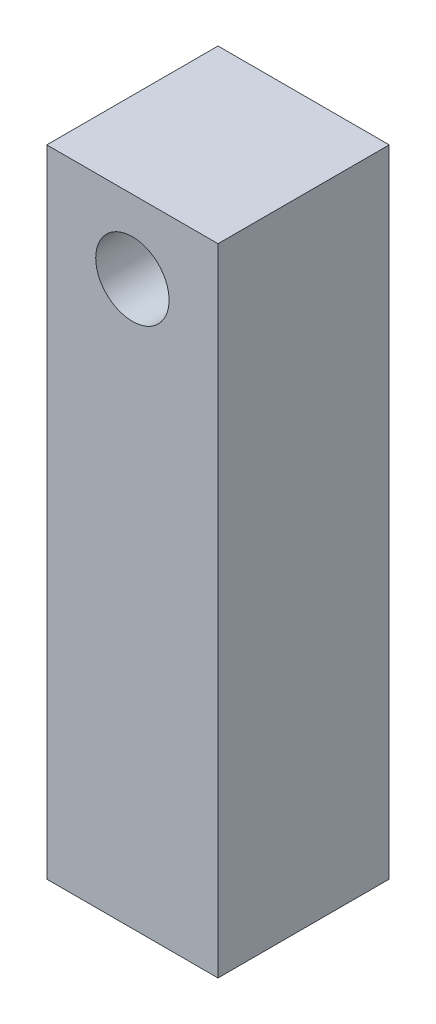
ISO-10303-21;
HEADER;
FILE_DESCRIPTION(('STEP AP214'),'2;1');
FILE_NAME('part.step','',(''),(''),'','','');
FILE_SCHEMA(('AUTOMOTIVE_DESIGN { 1 0 10303 214 1 1 1 1 }'));
ENDSEC;
DATA;
#1=APPLICATION_CONTEXT('core data for automotive mechanical design processes');
#2=APPLICATION_PROTOCOL_DEFINITION('international standard','automotive_design',2000,#1);
#3=PRODUCT_CONTEXT('',#1,'mechanical');
#4=PRODUCT('Part','Part','',(#3));
#5=PRODUCT_RELATED_PRODUCT_CATEGORY('part','',(#4));
#6=PRODUCT_DEFINITION_FORMATION('','',#4);
#7=PRODUCT_DEFINITION_CONTEXT('part definition',#1,'design');
#8=PRODUCT_DEFINITION('design','',#6,#7);
#9=PRODUCT_DEFINITION_SHAPE('','',#8);
#10=(LENGTH_UNIT() NAMED_UNIT(*) SI_UNIT(.MILLI.,.METRE.));
#11=(NAMED_UNIT(*) PLANE_ANGLE_UNIT() SI_UNIT($,.RADIAN.));
#12=(NAMED_UNIT(*) SI_UNIT($,.STERADIAN.) SOLID_ANGLE_UNIT());
#13=UNCERTAINTY_MEASURE_WITH_UNIT(LENGTH_MEASURE(1.E-05),#10,'distance_accuracy_value','');
#14=(GEOMETRIC_REPRESENTATION_CONTEXT(3) GLOBAL_UNCERTAINTY_ASSIGNED_CONTEXT((#13)) GLOBAL_UNIT_ASSIGNED_CONTEXT((#10,
#11,#12)) REPRESENTATION_CONTEXT('',''));
#15=CARTESIAN_POINT('',(0.,0.,0.));
#16=DIRECTION('',(0.,0.,1.));
#17=DIRECTION('',(1.,0.,0.));
#18=AXIS2_PLACEMENT_3D('',#15,#16,#17);
#19=CARTESIAN_POINT('',(0.,0.,0.));
#20=DIRECTION('',(0.,-1.,0.));
#21=DIRECTION('',(0.,0.,-1.));
#22=AXIS2_PLACEMENT_3D('',#19,#20,#21);
#23=PLANE('',#22);
#24=DIRECTION('',(0.,0.,-1.));
#25=VECTOR('',#24,1.);
#26=CARTESIAN_POINT('',(3.5,0.,3.5));
#27=LINE('',#26,#25);
#28=CARTESIAN_POINT('',(3.5,0.,3.5));
#29=VERTEX_POINT('',#28);
#30=CARTESIAN_POINT('',(3.5,0.,-3.5));
#31=VERTEX_POINT('',#30);
#32=EDGE_CURVE('E111',#29,#31,#27,.T.);
#33=ORIENTED_EDGE('',*,*,#32,.F.);
#34=DIRECTION('',(1.,0.,0.));
#35=VECTOR('',#34,1.);
#36=CARTESIAN_POINT('',(-3.5,0.,3.5));
#37=LINE('',#36,#35);
#38=CARTESIAN_POINT('',(-3.5,0.,3.5));
#39=VERTEX_POINT('',#38);
#40=EDGE_CURVE('E50',#39,#29,#37,.T.);
#41=ORIENTED_EDGE('',*,*,#40,.F.);
#42=DIRECTION('',(0.,0.,1.));
#43=VECTOR('',#42,1.);
#44=CARTESIAN_POINT('',(-3.5,0.,3.5));
#45=LINE('',#44,#43);
#46=CARTESIAN_POINT('',(-3.5,0.,-3.5));
#47=VERTEX_POINT('',#46);
#48=EDGE_CURVE('E58',#47,#39,#45,.T.);
#49=ORIENTED_EDGE('',*,*,#48,.F.);
#50=DIRECTION('',(-1.,0.,0.));
#51=VECTOR('',#50,1.);
#52=CARTESIAN_POINT('',(-3.5,0.,-3.5));
#53=LINE('',#52,#51);
#54=EDGE_CURVE('E81',#31,#47,#53,.T.);
#55=ORIENTED_EDGE('',*,*,#54,.F.);
#56=EDGE_LOOP('',(#33,#41,#49,#55));
#57=FACE_BOUND('',#56,.T.);
#58=CARTESIAN_POINT('',(0.,0.,0.));
#59=DIRECTION('',(0.,1.,0.));
#60=DIRECTION('',(0.,0.,1.));
#61=AXIS2_PLACEMENT_3D('',#58,#59,#60);
#62=CIRCLE('',#61,2.);
#63=CARTESIAN_POINT('',(0.,0.,2.));
#64=VERTEX_POINT('',#63);
#65=EDGE_CURVE('E108',#64,#64,#62,.T.);
#66=ORIENTED_EDGE('',*,*,#65,.T.);
#67=EDGE_LOOP('',(#66));
#68=FACE_BOUND('',#67,.T.);
#69=ADVANCED_FACE('F35',(#57,#68),#23,.T.);
#70=CARTESIAN_POINT('',(3.5,20.,3.5));
#71=DIRECTION('',(-1.,0.,0.));
#72=DIRECTION('',(0.,0.,1.));
#73=AXIS2_PLACEMENT_3D('',#70,#71,#72);
#74=PLANE('',#73);
#75=ORIENTED_EDGE('',*,*,#32,.T.);
#76=DIRECTION('',(0.,-1.,0.));
#77=VECTOR('',#76,1.);
#78=CARTESIAN_POINT('',(3.5,20.,-3.5));
#79=LINE('',#78,#77);
#80=CARTESIAN_POINT('',(3.5,26.,-3.5));
#81=VERTEX_POINT('',#80);
#82=EDGE_CURVE('E11',#81,#31,#79,.T.);
#83=ORIENTED_EDGE('',*,*,#82,.F.);
#84=DIRECTION('',(0.,0.,-1.));
#85=VECTOR('',#84,1.);
#86=CARTESIAN_POINT('',(3.5,26.,12.7195444572929));
#87=LINE('',#86,#85);
#88=CARTESIAN_POINT('',(3.5,26.,3.5));
#89=VERTEX_POINT('',#88);
#90=EDGE_CURVE('E90',#89,#81,#87,.T.);
#91=ORIENTED_EDGE('',*,*,#90,.F.);
#92=DIRECTION('',(0.,-1.,0.));
#93=VECTOR('',#92,1.);
#94=CARTESIAN_POINT('',(3.5,20.,3.5));
#95=LINE('',#94,#93);
#96=EDGE_CURVE('E117',#89,#29,#95,.T.);
#97=ORIENTED_EDGE('',*,*,#96,.T.);
#98=EDGE_LOOP('',(#75,#83,#91,#97));
#99=FACE_BOUND('',#98,.T.);
#100=ADVANCED_FACE('F37',(#99),#74,.F.);
#101=CARTESIAN_POINT('',(-3.5,20.,-3.5));
#102=DIRECTION('',(0.,0.,1.));
#103=DIRECTION('',(1.,0.,0.));
#104=AXIS2_PLACEMENT_3D('',#101,#102,#103);
#105=PLANE('',#104);
#106=ORIENTED_EDGE('',*,*,#54,.T.);
#107=DIRECTION('',(0.,-1.,0.));
#108=VECTOR('',#107,1.);
#109=CARTESIAN_POINT('',(-3.5,20.,-3.5));
#110=LINE('',#109,#108);
#111=CARTESIAN_POINT('',(-3.5,26.,-3.5));
#112=VERTEX_POINT('',#111);
#113=EDGE_CURVE('E43',#112,#47,#110,.T.);
#114=ORIENTED_EDGE('',*,*,#113,.F.);
#115=DIRECTION('',(1.,0.,0.));
#116=VECTOR('',#115,1.);
#117=CARTESIAN_POINT('',(-3.5,26.,-3.5));
#118=LINE('',#117,#116);
#119=EDGE_CURVE('E80',#112,#81,#118,.T.);
#120=ORIENTED_EDGE('',*,*,#119,.T.);
#121=ORIENTED_EDGE('',*,*,#82,.T.);
#122=EDGE_LOOP('',(#106,#114,#120,#121));
#123=FACE_BOUND('',#122,.T.);
#124=CARTESIAN_POINT('',(0.,23.,-3.5));
#125=DIRECTION('',(0.,0.,1.));
#126=DIRECTION('',(1.,0.,0.));
#127=AXIS2_PLACEMENT_3D('',#124,#125,#126);
#128=CIRCLE('',#127,1.5);
#129=CARTESIAN_POINT('',(1.5,23.,-3.5));
#130=VERTEX_POINT('',#129);
#131=EDGE_CURVE('E95',#130,#130,#128,.F.);
#132=ORIENTED_EDGE('',*,*,#131,.F.);
#133=EDGE_LOOP('',(#132));
#134=FACE_BOUND('',#133,.T.);
#135=ADVANCED_FACE('F77',(#123,#134),#105,.F.);
#136=CARTESIAN_POINT('',(-3.5,20.,3.5));
#137=DIRECTION('',(1.,0.,0.));
#138=DIRECTION('',(0.,0.,-1.));
#139=AXIS2_PLACEMENT_3D('',#136,#137,#138);
#140=PLANE('',#139);
#141=ORIENTED_EDGE('',*,*,#48,.T.);
#142=DIRECTION('',(0.,-1.,0.));
#143=VECTOR('',#142,1.);
#144=CARTESIAN_POINT('',(-3.5,20.,3.5));
#145=LINE('',#144,#143);
#146=CARTESIAN_POINT('',(-3.5,26.,3.5));
#147=VERTEX_POINT('',#146);
#148=EDGE_CURVE('E82',#147,#39,#145,.T.);
#149=ORIENTED_EDGE('',*,*,#148,.F.);
#150=DIRECTION('',(0.,0.,-1.));
#151=VECTOR('',#150,1.);
#152=CARTESIAN_POINT('',(-3.5,26.,12.7195444572929));
#153=LINE('',#152,#151);
#154=EDGE_CURVE('E84',#147,#112,#153,.T.);
#155=ORIENTED_EDGE('',*,*,#154,.T.);
#156=ORIENTED_EDGE('',*,*,#113,.T.);
#157=EDGE_LOOP('',(#141,#149,#155,#156));
#158=FACE_BOUND('',#157,.T.);
#159=ADVANCED_FACE('F85',(#158),#140,.F.);
#160=CARTESIAN_POINT('',(-3.5,20.,3.5));
#161=DIRECTION('',(0.,0.,-1.));
#162=DIRECTION('',(-1.,0.,0.));
#163=AXIS2_PLACEMENT_3D('',#160,#161,#162);
#164=PLANE('',#163);
#165=ORIENTED_EDGE('',*,*,#40,.T.);
#166=ORIENTED_EDGE('',*,*,#96,.F.);
#167=DIRECTION('',(1.,0.,0.));
#168=VECTOR('',#167,1.);
#169=CARTESIAN_POINT('',(-3.5,26.,3.5));
#170=LINE('',#169,#168);
#171=EDGE_CURVE('E98',#147,#89,#170,.T.);
#172=ORIENTED_EDGE('',*,*,#171,.F.);
#173=ORIENTED_EDGE('',*,*,#148,.T.);
#174=EDGE_LOOP('',(#165,#166,#172,#173));
#175=FACE_BOUND('',#174,.T.);
#176=CARTESIAN_POINT('',(0.,23.,3.5));
#177=DIRECTION('',(0.,0.,-1.));
#178=DIRECTION('',(-1.,0.,0.));
#179=AXIS2_PLACEMENT_3D('',#176,#177,#178);
#180=CIRCLE('',#179,1.5);
#181=CARTESIAN_POINT('',(-1.5,23.,3.5));
#182=VERTEX_POINT('',#181);
#183=EDGE_CURVE('E89',#182,#182,#180,.T.);
#184=ORIENTED_EDGE('',*,*,#183,.T.);
#185=EDGE_LOOP('',(#184));
#186=FACE_BOUND('',#185,.T.);
#187=ADVANCED_FACE('F119',(#175,#186),#164,.F.);
#188=CARTESIAN_POINT('',(0.,20.,0.));
#189=DIRECTION('',(0.,-1.,0.));
#190=DIRECTION('',(0.,0.,-1.));
#191=AXIS2_PLACEMENT_3D('',#188,#189,#190);
#192=CYLINDRICAL_SURFACE('',#191,2.);
#193=CARTESIAN_POINT('',(0.,20.,0.));
#194=DIRECTION('',(0.,1.,0.));
#195=DIRECTION('',(0.,0.,1.));
#196=AXIS2_PLACEMENT_3D('',#193,#194,#195);
#197=CIRCLE('',#196,2.);
#198=CARTESIAN_POINT('',(0.,20.,2.));
#199=VERTEX_POINT('',#198);
#200=EDGE_CURVE('E105',#199,#199,#197,.T.);
#201=ORIENTED_EDGE('',*,*,#200,.T.);
#202=EDGE_LOOP('',(#201));
#203=FACE_BOUND('',#202,.T.);
#204=ORIENTED_EDGE('',*,*,#65,.F.);
#205=EDGE_LOOP('',(#204));
#206=FACE_BOUND('',#205,.T.);
#207=ADVANCED_FACE('F135',(#203,#206),#192,.F.);
#208=CARTESIAN_POINT('',(-3.5,20.,12.7195444572929));
#209=DIRECTION('',(0.,1.,0.));
#210=DIRECTION('',(0.,0.,1.));
#211=AXIS2_PLACEMENT_3D('',#208,#209,#210);
#212=PLANE('',#211);
#213=ORIENTED_EDGE('',*,*,#200,.F.);
#214=EDGE_LOOP('',(#213));
#215=FACE_BOUND('',#214,.T.);
#216=ADVANCED_FACE('F155',(#215),#212,.F.);
#217=CARTESIAN_POINT('',(-3.5,26.,12.7195444572929));
#218=DIRECTION('',(0.,-1.,0.));
#219=DIRECTION('',(0.,0.,-1.));
#220=AXIS2_PLACEMENT_3D('',#217,#218,#219);
#221=PLANE('',#220);
#222=ORIENTED_EDGE('',*,*,#154,.F.);
#223=ORIENTED_EDGE('',*,*,#171,.T.);
#224=ORIENTED_EDGE('',*,*,#90,.T.);
#225=ORIENTED_EDGE('',*,*,#119,.F.);
#226=EDGE_LOOP('',(#222,#223,#224,#225));
#227=FACE_BOUND('',#226,.T.);
#228=ADVANCED_FACE('F93',(#227),#221,.F.);
#229=CARTESIAN_POINT('',(0.,23.,12.7195444572929));
#230=DIRECTION('',(0.,0.,-1.));
#231=DIRECTION('',(-1.,0.,0.));
#232=AXIS2_PLACEMENT_3D('',#229,#230,#231);
#233=CYLINDRICAL_SURFACE('',#232,1.5);
#234=ORIENTED_EDGE('',*,*,#183,.F.);
#235=EDGE_LOOP('',(#234));
#236=FACE_BOUND('',#235,.T.);
#237=ORIENTED_EDGE('',*,*,#131,.T.);
#238=EDGE_LOOP('',(#237));
#239=FACE_BOUND('',#238,.T.);
#240=ADVANCED_FACE('F168',(#236,#239),#233,.F.);
#241=CLOSED_SHELL('',(#69,#100,#135,#159,#187,#207,#216,#228,#240));
#242=MANIFOLD_SOLID_BREP('B2',#241);
#243=ADVANCED_BREP_SHAPE_REPRESENTATION('',(#18,#242),#14);
#244=SHAPE_DEFINITION_REPRESENTATION(#9,#243);
ENDSEC;
END-ISO-10303-21;
